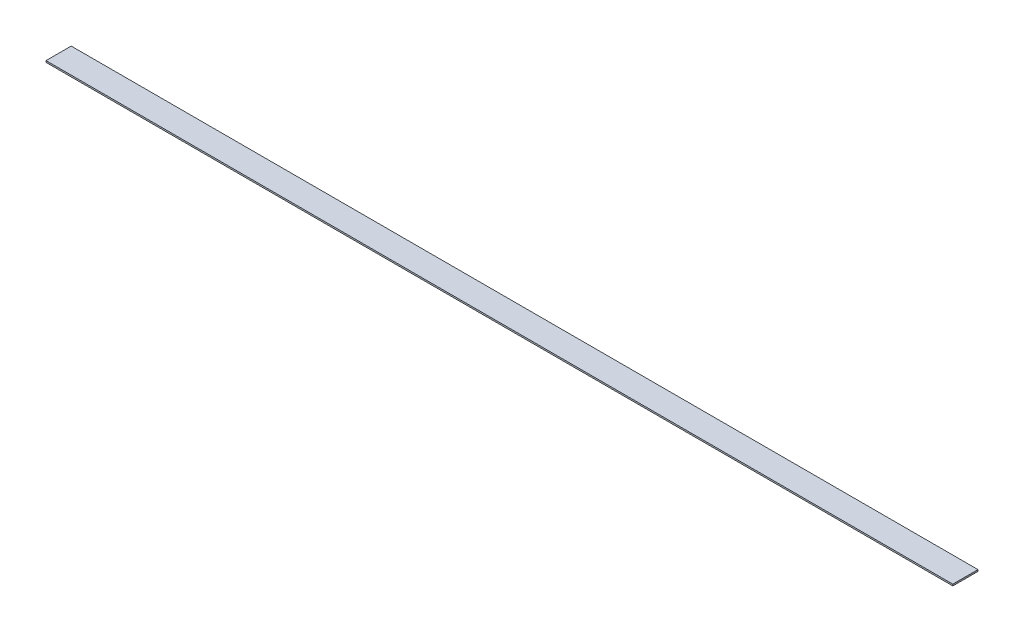
ISO-10303-21;
HEADER;
FILE_DESCRIPTION(('STEP AP214'),'2;1');
FILE_NAME('part.step','',(''),(''),'','','');
FILE_SCHEMA(('AUTOMOTIVE_DESIGN { 1 0 10303 214 1 1 1 1 }'));
ENDSEC;
DATA;
#1=APPLICATION_CONTEXT('core data for automotive mechanical design processes');
#2=APPLICATION_PROTOCOL_DEFINITION('international standard','automotive_design',2000,#1);
#3=PRODUCT_CONTEXT('',#1,'mechanical');
#4=PRODUCT('Part','Part','',(#3));
#5=PRODUCT_RELATED_PRODUCT_CATEGORY('part','',(#4));
#6=PRODUCT_DEFINITION_FORMATION('','',#4);
#7=PRODUCT_DEFINITION_CONTEXT('part definition',#1,'design');
#8=PRODUCT_DEFINITION('design','',#6,#7);
#9=PRODUCT_DEFINITION_SHAPE('','',#8);
#10=(LENGTH_UNIT() NAMED_UNIT(*) SI_UNIT(.MILLI.,.METRE.));
#11=(NAMED_UNIT(*) PLANE_ANGLE_UNIT() SI_UNIT($,.RADIAN.));
#12=(NAMED_UNIT(*) SI_UNIT($,.STERADIAN.) SOLID_ANGLE_UNIT());
#13=UNCERTAINTY_MEASURE_WITH_UNIT(LENGTH_MEASURE(1.E-05),#10,'distance_accuracy_value','');
#14=(GEOMETRIC_REPRESENTATION_CONTEXT(3) GLOBAL_UNCERTAINTY_ASSIGNED_CONTEXT((#13)) GLOBAL_UNIT_ASSIGNED_CONTEXT((#10,
#11,#12)) REPRESENTATION_CONTEXT('',''));
#15=CARTESIAN_POINT('',(0.,0.,0.));
#16=DIRECTION('',(0.,0.,1.));
#17=DIRECTION('',(1.,0.,0.));
#18=AXIS2_PLACEMENT_3D('',#15,#16,#17);
#19=CARTESIAN_POINT('',(0.,1.5875,0.));
#20=DIRECTION('',(1.,0.,0.));
#21=DIRECTION('',(0.,0.,-1.));
#22=AXIS2_PLACEMENT_3D('',#19,#20,#21);
#23=PLANE('',#22);
#24=DIRECTION('',(0.,0.,1.));
#25=VECTOR('',#24,1.);
#26=CARTESIAN_POINT('',(0.,0.,0.));
#27=LINE('',#26,#25);
#28=CARTESIAN_POINT('',(0.,0.,-25.4));
#29=VERTEX_POINT('',#28);
#30=CARTESIAN_POINT('',(0.,0.,0.));
#31=VERTEX_POINT('',#30);
#32=EDGE_CURVE('E97',#29,#31,#27,.T.);
#33=ORIENTED_EDGE('',*,*,#32,.T.);
#34=DIRECTION('',(0.,-1.,0.));
#35=VECTOR('',#34,1.);
#36=CARTESIAN_POINT('',(0.,1.5875,0.));
#37=LINE('',#36,#35);
#38=CARTESIAN_POINT('',(0.,1.5875,0.));
#39=VERTEX_POINT('',#38);
#40=EDGE_CURVE('E11',#39,#31,#37,.T.);
#41=ORIENTED_EDGE('',*,*,#40,.F.);
#42=DIRECTION('',(0.,0.,1.));
#43=VECTOR('',#42,1.);
#44=CARTESIAN_POINT('',(0.,1.5875,0.));
#45=LINE('',#44,#43);
#46=CARTESIAN_POINT('',(0.,1.5875,-25.4));
#47=VERTEX_POINT('',#46);
#48=EDGE_CURVE('E85',#47,#39,#45,.T.);
#49=ORIENTED_EDGE('',*,*,#48,.F.);
#50=DIRECTION('',(0.,-1.,0.));
#51=VECTOR('',#50,1.);
#52=CARTESIAN_POINT('',(0.,1.5875,-25.4));
#53=LINE('',#52,#51);
#54=EDGE_CURVE('E93',#47,#29,#53,.T.);
#55=ORIENTED_EDGE('',*,*,#54,.T.);
#56=EDGE_LOOP('',(#33,#41,#49,#55));
#57=FACE_BOUND('',#56,.T.);
#58=ADVANCED_FACE('F34',(#57),#23,.F.);
#59=CARTESIAN_POINT('',(0.,1.5875,0.));
#60=DIRECTION('',(0.,0.,-1.));
#61=DIRECTION('',(-1.,0.,0.));
#62=AXIS2_PLACEMENT_3D('',#59,#60,#61);
#63=PLANE('',#62);
#64=DIRECTION('',(1.,0.,0.));
#65=VECTOR('',#64,1.);
#66=CARTESIAN_POINT('',(0.,0.,0.));
#67=LINE('',#66,#65);
#68=CARTESIAN_POINT('',(914.4,0.,0.));
#69=VERTEX_POINT('',#68);
#70=EDGE_CURVE('E89',#31,#69,#67,.T.);
#71=ORIENTED_EDGE('',*,*,#70,.T.);
#72=DIRECTION('',(0.,-1.,0.));
#73=VECTOR('',#72,1.);
#74=CARTESIAN_POINT('',(914.4,1.5875,0.));
#75=LINE('',#74,#73);
#76=CARTESIAN_POINT('',(914.4,1.5875,0.));
#77=VERTEX_POINT('',#76);
#78=EDGE_CURVE('E42',#77,#69,#75,.T.);
#79=ORIENTED_EDGE('',*,*,#78,.F.);
#80=DIRECTION('',(1.,0.,0.));
#81=VECTOR('',#80,1.);
#82=CARTESIAN_POINT('',(0.,1.5875,0.));
#83=LINE('',#82,#81);
#84=EDGE_CURVE('E80',#39,#77,#83,.T.);
#85=ORIENTED_EDGE('',*,*,#84,.F.);
#86=ORIENTED_EDGE('',*,*,#40,.T.);
#87=EDGE_LOOP('',(#71,#79,#85,#86));
#88=FACE_BOUND('',#87,.T.);
#89=ADVANCED_FACE('F88',(#88),#63,.F.);
#90=CARTESIAN_POINT('',(914.4,1.5875,0.));
#91=DIRECTION('',(-1.,0.,0.));
#92=DIRECTION('',(0.,0.,1.));
#93=AXIS2_PLACEMENT_3D('',#90,#91,#92);
#94=PLANE('',#93);
#95=DIRECTION('',(0.,0.,-1.));
#96=VECTOR('',#95,1.);
#97=CARTESIAN_POINT('',(914.4,0.,0.));
#98=LINE('',#97,#96);
#99=CARTESIAN_POINT('',(914.4,0.,-25.4));
#100=VERTEX_POINT('',#99);
#101=EDGE_CURVE('E67',#69,#100,#98,.T.);
#102=ORIENTED_EDGE('',*,*,#101,.T.);
#103=DIRECTION('',(0.,-1.,0.));
#104=VECTOR('',#103,1.);
#105=CARTESIAN_POINT('',(914.4,1.5875,-25.4));
#106=LINE('',#105,#104);
#107=CARTESIAN_POINT('',(914.4,1.5875,-25.4));
#108=VERTEX_POINT('',#107);
#109=EDGE_CURVE('E90',#108,#100,#106,.T.);
#110=ORIENTED_EDGE('',*,*,#109,.F.);
#111=DIRECTION('',(0.,0.,-1.));
#112=VECTOR('',#111,1.);
#113=CARTESIAN_POINT('',(914.4,1.5875,0.));
#114=LINE('',#113,#112);
#115=EDGE_CURVE('E83',#77,#108,#114,.T.);
#116=ORIENTED_EDGE('',*,*,#115,.F.);
#117=ORIENTED_EDGE('',*,*,#78,.T.);
#118=EDGE_LOOP('',(#102,#110,#116,#117));
#119=FACE_BOUND('',#118,.T.);
#120=ADVANCED_FACE('F91',(#119),#94,.F.);
#121=CARTESIAN_POINT('',(0.,1.5875,-25.4));
#122=DIRECTION('',(0.,0.,1.));
#123=DIRECTION('',(1.,0.,0.));
#124=AXIS2_PLACEMENT_3D('',#121,#122,#123);
#125=PLANE('',#124);
#126=DIRECTION('',(-1.,0.,0.));
#127=VECTOR('',#126,1.);
#128=CARTESIAN_POINT('',(0.,0.,-25.4));
#129=LINE('',#128,#127);
#130=EDGE_CURVE('E73',#100,#29,#129,.T.);
#131=ORIENTED_EDGE('',*,*,#130,.T.);
#132=ORIENTED_EDGE('',*,*,#54,.F.);
#133=DIRECTION('',(-1.,0.,0.));
#134=VECTOR('',#133,1.);
#135=CARTESIAN_POINT('',(0.,1.5875,-25.4));
#136=LINE('',#135,#134);
#137=EDGE_CURVE('E50',#108,#47,#136,.T.);
#138=ORIENTED_EDGE('',*,*,#137,.F.);
#139=ORIENTED_EDGE('',*,*,#109,.T.);
#140=EDGE_LOOP('',(#131,#132,#138,#139));
#141=FACE_BOUND('',#140,.T.);
#142=ADVANCED_FACE('F104',(#141),#125,.F.);
#143=CARTESIAN_POINT('',(0.,1.5875,0.));
#144=DIRECTION('',(0.,-1.,0.));
#145=DIRECTION('',(0.,0.,-1.));
#146=AXIS2_PLACEMENT_3D('',#143,#144,#145);
#147=PLANE('',#146);
#148=ORIENTED_EDGE('',*,*,#48,.T.);
#149=ORIENTED_EDGE('',*,*,#84,.T.);
#150=ORIENTED_EDGE('',*,*,#115,.T.);
#151=ORIENTED_EDGE('',*,*,#137,.T.);
#152=EDGE_LOOP('',(#148,#149,#150,#151));
#153=FACE_BOUND('',#152,.T.);
#154=ADVANCED_FACE('F81',(#153),#147,.F.);
#155=CARTESIAN_POINT('',(0.,0.,0.));
#156=DIRECTION('',(0.,-1.,0.));
#157=DIRECTION('',(0.,0.,-1.));
#158=AXIS2_PLACEMENT_3D('',#155,#156,#157);
#159=PLANE('',#158);
#160=ORIENTED_EDGE('',*,*,#32,.F.);
#161=ORIENTED_EDGE('',*,*,#130,.F.);
#162=ORIENTED_EDGE('',*,*,#101,.F.);
#163=ORIENTED_EDGE('',*,*,#70,.F.);
#164=EDGE_LOOP('',(#160,#161,#162,#163));
#165=FACE_BOUND('',#164,.T.);
#166=ADVANCED_FACE('F107',(#165),#159,.T.);
#167=CLOSED_SHELL('',(#58,#89,#120,#142,#154,#166));
#168=MANIFOLD_SOLID_BREP('B2',#167);
#169=ADVANCED_BREP_SHAPE_REPRESENTATION('',(#18,#168),#14);
#170=SHAPE_DEFINITION_REPRESENTATION(#9,#169);
ENDSEC;
END-ISO-10303-21;
